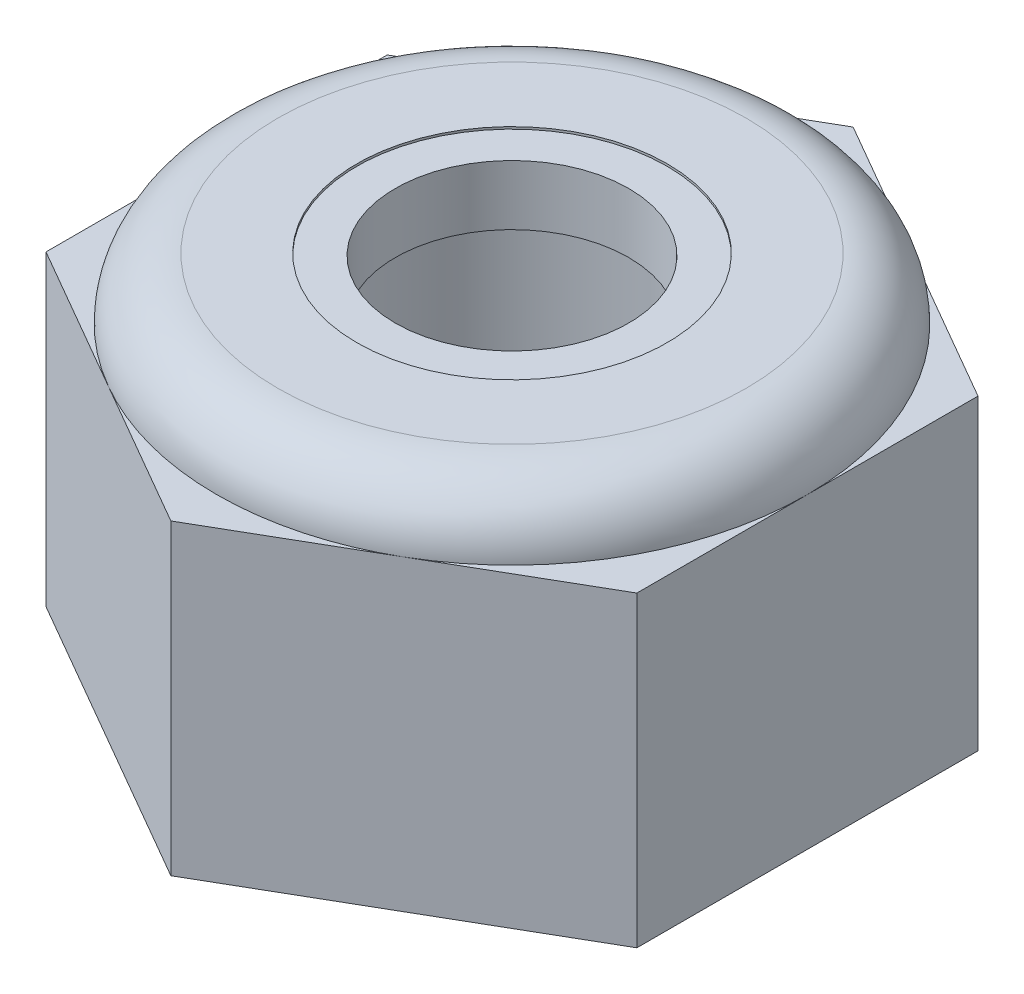
ISO-10303-21;
HEADER;
FILE_DESCRIPTION(('STEP AP214'),'2;1');
FILE_NAME('part.step','',(''),(''),'','','');
FILE_SCHEMA(('AUTOMOTIVE_DESIGN { 1 0 10303 214 1 1 1 1 }'));
ENDSEC;
DATA;
#1=APPLICATION_CONTEXT('core data for automotive mechanical design processes');
#2=APPLICATION_PROTOCOL_DEFINITION('international standard','automotive_design',2000,#1);
#3=PRODUCT_CONTEXT('',#1,'mechanical');
#4=PRODUCT('Part','Part','',(#3));
#5=PRODUCT_RELATED_PRODUCT_CATEGORY('part','',(#4));
#6=PRODUCT_DEFINITION_FORMATION('','',#4);
#7=PRODUCT_DEFINITION_CONTEXT('part definition',#1,'design');
#8=PRODUCT_DEFINITION('design','',#6,#7);
#9=PRODUCT_DEFINITION_SHAPE('','',#8);
#10=(LENGTH_UNIT() NAMED_UNIT(*) SI_UNIT(.MILLI.,.METRE.));
#11=(NAMED_UNIT(*) PLANE_ANGLE_UNIT() SI_UNIT($,.RADIAN.));
#12=(NAMED_UNIT(*) SI_UNIT($,.STERADIAN.) SOLID_ANGLE_UNIT());
#13=UNCERTAINTY_MEASURE_WITH_UNIT(LENGTH_MEASURE(1.E-05),#10,'distance_accuracy_value','');
#14=(GEOMETRIC_REPRESENTATION_CONTEXT(3) GLOBAL_UNCERTAINTY_ASSIGNED_CONTEXT((#13)) GLOBAL_UNIT_ASSIGNED_CONTEXT((#10,
#11,#12)) REPRESENTATION_CONTEXT('',''));
#15=CARTESIAN_POINT('',(0.,0.,0.));
#16=DIRECTION('',(0.,0.,1.));
#17=DIRECTION('',(1.,0.,0.));
#18=AXIS2_PLACEMENT_3D('',#15,#16,#17);
#19=CARTESIAN_POINT('',(0.,0.,0.));
#20=DIRECTION('',(0.,-1.,0.));
#21=DIRECTION('',(0.,0.,-1.));
#22=AXIS2_PLACEMENT_3D('',#19,#20,#21);
#23=CYLINDRICAL_SURFACE('',#22,2.09999999999999);
#24=CARTESIAN_POINT('',(0.,4.989999906,0.));
#25=DIRECTION('',(0.,-1.,0.));
#26=DIRECTION('',(0.,0.,-1.));
#27=AXIS2_PLACEMENT_3D('',#24,#25,#26);
#28=CIRCLE('',#27,2.1);
#29=CARTESIAN_POINT('',(0.,4.989999906,-2.1));
#30=VERTEX_POINT('',#29);
#31=EDGE_CURVE('E197',#30,#30,#28,.T.);
#32=ORIENTED_EDGE('',*,*,#31,.F.);
#33=EDGE_LOOP('',(#32));
#34=FACE_BOUND('',#33,.T.);
#35=CARTESIAN_POINT('',(0.,4.959999966,0.));
#36=DIRECTION('',(0.,-1.,0.));
#37=DIRECTION('',(0.,0.,-1.));
#38=AXIS2_PLACEMENT_3D('',#35,#36,#37);
#39=CIRCLE('',#38,2.09999999999999);
#40=CARTESIAN_POINT('',(0.,4.959999966,-2.09999999999999));
#41=VERTEX_POINT('',#40);
#42=EDGE_CURVE('E11',#41,#41,#39,.F.);
#43=ORIENTED_EDGE('',*,*,#42,.F.);
#44=EDGE_LOOP('',(#43));
#45=FACE_BOUND('',#44,.T.);
#46=ADVANCED_FACE('F37',(#34,#45),#23,.F.);
#47=CARTESIAN_POINT('',(0.,0.,0.));
#48=DIRECTION('',(0.,-1.,0.));
#49=DIRECTION('',(0.,0.,-1.));
#50=AXIS2_PLACEMENT_3D('',#47,#48,#49);
#51=CIRCLE('',#50,2.09999999999999);
#52=CARTESIAN_POINT('',(0.,0.,-2.09999999999999));
#53=VERTEX_POINT('',#52);
#54=EDGE_CURVE('E214',#53,#53,#51,.T.);
#55=ORIENTED_EDGE('',*,*,#54,.T.);
#56=EDGE_LOOP('',(#55));
#57=FACE_BOUND('',#56,.T.);
#58=CARTESIAN_POINT('',(0.,4.149999966,0.));
#59=DIRECTION('',(0.,1.,0.));
#60=DIRECTION('',(0.,0.,1.));
#61=AXIS2_PLACEMENT_3D('',#58,#59,#60);
#62=CIRCLE('',#61,2.09999999999999);
#63=CARTESIAN_POINT('',(0.,4.149999966,2.09999999999999));
#64=VERTEX_POINT('',#63);
#65=EDGE_CURVE('E45',#64,#64,#62,.F.);
#66=ORIENTED_EDGE('',*,*,#65,.F.);
#67=EDGE_LOOP('',(#66));
#68=FACE_BOUND('',#67,.T.);
#69=ADVANCED_FACE('F240',(#57,#68),#23,.F.);
#70=CARTESIAN_POINT('',(0.,0.,0.));
#71=DIRECTION('',(0.,1.,0.));
#72=DIRECTION('',(0.,0.,1.));
#73=AXIS2_PLACEMENT_3D('',#70,#71,#72);
#74=PLANE('',#73);
#75=DIRECTION('',(0.,0.,1.));
#76=VECTOR('',#75,1.);
#77=CARTESIAN_POINT('',(-4.,0.,-2.3094010767585));
#78=LINE('',#77,#76);
#79=CARTESIAN_POINT('',(-4.,0.,-2.3094010767585));
#80=VERTEX_POINT('',#79);
#81=CARTESIAN_POINT('',(-4.,0.,2.3094010767585));
#82=VERTEX_POINT('',#81);
#83=EDGE_CURVE('E148',#80,#82,#78,.T.);
#84=ORIENTED_EDGE('',*,*,#83,.F.);
#85=DIRECTION('',(-0.866025403784438,0.,0.5));
#86=VECTOR('',#85,1.);
#87=CARTESIAN_POINT('',(0.,0.,-4.61880215351701));
#88=LINE('',#87,#86);
#89=CARTESIAN_POINT('',(0.,0.,-4.61880215351701));
#90=VERTEX_POINT('',#89);
#91=EDGE_CURVE('E89',#90,#80,#88,.T.);
#92=ORIENTED_EDGE('',*,*,#91,.F.);
#93=DIRECTION('',(-0.866025403784439,0.,-0.5));
#94=VECTOR('',#93,1.);
#95=CARTESIAN_POINT('',(4.,0.,-2.3094010767585));
#96=LINE('',#95,#94);
#97=CARTESIAN_POINT('',(4.,0.,-2.3094010767585));
#98=VERTEX_POINT('',#97);
#99=EDGE_CURVE('E157',#98,#90,#96,.T.);
#100=ORIENTED_EDGE('',*,*,#99,.F.);
#101=DIRECTION('',(0.,0.,-1.));
#102=VECTOR('',#101,1.);
#103=CARTESIAN_POINT('',(4.,0.,2.3094010767585));
#104=LINE('',#103,#102);
#105=CARTESIAN_POINT('',(4.,0.,2.3094010767585));
#106=VERTEX_POINT('',#105);
#107=EDGE_CURVE('E131',#106,#98,#104,.T.);
#108=ORIENTED_EDGE('',*,*,#107,.F.);
#109=DIRECTION('',(0.866025403784438,0.,-0.5));
#110=VECTOR('',#109,1.);
#111=CARTESIAN_POINT('',(0.,0.,4.61880215351701));
#112=LINE('',#111,#110);
#113=CARTESIAN_POINT('',(0.,0.,4.61880215351701));
#114=VERTEX_POINT('',#113);
#115=EDGE_CURVE('E154',#114,#106,#112,.T.);
#116=ORIENTED_EDGE('',*,*,#115,.F.);
#117=DIRECTION('',(0.866025403784439,0.,0.5));
#118=VECTOR('',#117,1.);
#119=CARTESIAN_POINT('',(-4.,0.,2.3094010767585));
#120=LINE('',#119,#118);
#121=EDGE_CURVE('E151',#82,#114,#120,.T.);
#122=ORIENTED_EDGE('',*,*,#121,.F.);
#123=EDGE_LOOP('',(#84,#92,#100,#108,#116,#122));
#124=FACE_BOUND('',#123,.T.);
#125=ORIENTED_EDGE('',*,*,#54,.F.);
#126=EDGE_LOOP('',(#125));
#127=FACE_BOUND('',#126,.T.);
#128=ADVANCED_FACE('F246',(#124,#127),#74,.F.);
#129=CARTESIAN_POINT('',(0.,4.159999906,0.));
#130=DIRECTION('',(0.,1.,0.));
#131=DIRECTION('',(0.,0.,1.));
#132=AXIS2_PLACEMENT_3D('',#129,#130,#131);
#133=PLANE('',#132);
#134=DIRECTION('',(0.866025403784439,0.,0.5));
#135=VECTOR('',#134,1.);
#136=CARTESIAN_POINT('',(-4.,4.159999906,2.3094010767585));
#137=LINE('',#136,#135);
#138=CARTESIAN_POINT('',(-4.,4.159999906,2.3094010767585));
#139=VERTEX_POINT('',#138);
#140=CARTESIAN_POINT('',(-2.,4.159999906,3.46410161513775));
#141=VERTEX_POINT('',#140);
#142=EDGE_CURVE('E202',#139,#141,#137,.T.);
#143=ORIENTED_EDGE('',*,*,#142,.T.);
#144=CARTESIAN_POINT('',(0.,4.159999906,0.));
#145=DIRECTION('',(0.,1.,0.));
#146=DIRECTION('',(0.,0.,1.));
#147=AXIS2_PLACEMENT_3D('',#144,#145,#146);
#148=CIRCLE('',#147,4.);
#149=CARTESIAN_POINT('',(-4.,4.159999906,0.));
#150=VERTEX_POINT('',#149);
#151=EDGE_CURVE('E52',#141,#150,#148,.F.);
#152=ORIENTED_EDGE('',*,*,#151,.T.);
#153=DIRECTION('',(0.,0.,1.));
#154=VECTOR('',#153,1.);
#155=CARTESIAN_POINT('',(-4.,4.159999906,-2.3094010767585));
#156=LINE('',#155,#154);
#157=EDGE_CURVE('E97',#150,#139,#156,.T.);
#158=ORIENTED_EDGE('',*,*,#157,.T.);
#159=EDGE_LOOP('',(#143,#152,#158));
#160=FACE_BOUND('',#159,.T.);
#161=ADVANCED_FACE('F257',(#160),#133,.T.);
#162=CARTESIAN_POINT('',(-4.,4.159999906,-2.3094010767585));
#163=VERTEX_POINT('',#162);
#164=EDGE_CURVE('E208',#163,#150,#156,.T.);
#165=ORIENTED_EDGE('',*,*,#164,.T.);
#166=CARTESIAN_POINT('',(-2.,4.159999906,-3.46410161513775));
#167=VERTEX_POINT('',#166);
#168=EDGE_CURVE('E173',#150,#167,#148,.F.);
#169=ORIENTED_EDGE('',*,*,#168,.T.);
#170=DIRECTION('',(-0.866025403784438,0.,0.5));
#171=VECTOR('',#170,1.);
#172=CARTESIAN_POINT('',(0.,4.159999906,-4.61880215351701));
#173=LINE('',#172,#171);
#174=EDGE_CURVE('E61',#167,#163,#173,.T.);
#175=ORIENTED_EDGE('',*,*,#174,.T.);
#176=EDGE_LOOP('',(#165,#169,#175));
#177=FACE_BOUND('',#176,.T.);
#178=ADVANCED_FACE('F260',(#177),#133,.T.);
#179=CARTESIAN_POINT('',(0.,4.159999906,-4.61880215351701));
#180=VERTEX_POINT('',#179);
#181=EDGE_CURVE('E142',#180,#167,#173,.T.);
#182=ORIENTED_EDGE('',*,*,#181,.T.);
#183=CARTESIAN_POINT('',(2.,4.159999906,-3.46410161513775));
#184=VERTEX_POINT('',#183);
#185=EDGE_CURVE('E174',#167,#184,#148,.F.);
#186=ORIENTED_EDGE('',*,*,#185,.T.);
#187=DIRECTION('',(-0.866025403784439,0.,-0.5));
#188=VECTOR('',#187,1.);
#189=CARTESIAN_POINT('',(4.,4.159999906,-2.3094010767585));
#190=LINE('',#189,#188);
#191=EDGE_CURVE('E140',#184,#180,#190,.T.);
#192=ORIENTED_EDGE('',*,*,#191,.T.);
#193=EDGE_LOOP('',(#182,#186,#192));
#194=FACE_BOUND('',#193,.T.);
#195=ADVANCED_FACE('F179',(#194),#133,.T.);
#196=CARTESIAN_POINT('',(4.,4.159999906,-2.3094010767585));
#197=VERTEX_POINT('',#196);
#198=EDGE_CURVE('E116',#197,#184,#190,.T.);
#199=ORIENTED_EDGE('',*,*,#198,.T.);
#200=CARTESIAN_POINT('',(4.,4.159999906,0.));
#201=VERTEX_POINT('',#200);
#202=EDGE_CURVE('E119',#184,#201,#148,.F.);
#203=ORIENTED_EDGE('',*,*,#202,.T.);
#204=DIRECTION('',(0.,0.,-1.));
#205=VECTOR('',#204,1.);
#206=CARTESIAN_POINT('',(4.,4.159999906,2.3094010767585));
#207=LINE('',#206,#205);
#208=EDGE_CURVE('E111',#201,#197,#207,.T.);
#209=ORIENTED_EDGE('',*,*,#208,.T.);
#210=EDGE_LOOP('',(#199,#203,#209));
#211=FACE_BOUND('',#210,.T.);
#212=ADVANCED_FACE('F113',(#211),#133,.T.);
#213=CARTESIAN_POINT('',(4.,4.159999906,2.3094010767585));
#214=VERTEX_POINT('',#213);
#215=EDGE_CURVE('E123',#214,#201,#207,.T.);
#216=ORIENTED_EDGE('',*,*,#215,.T.);
#217=CARTESIAN_POINT('',(0.,4.159999906,0.));
#218=DIRECTION('',(0.,1.,0.));
#219=DIRECTION('',(0.,0.,1.));
#220=AXIS2_PLACEMENT_3D('',#217,#218,#219);
#221=CIRCLE('',#220,4.);
#222=CARTESIAN_POINT('',(2.,4.159999906,3.46410161513775));
#223=VERTEX_POINT('',#222);
#224=EDGE_CURVE('E188',#223,#201,#221,.T.);
#225=ORIENTED_EDGE('',*,*,#224,.F.);
#226=DIRECTION('',(0.866025403784438,0.,-0.5));
#227=VECTOR('',#226,1.);
#228=CARTESIAN_POINT('',(0.,4.159999906,4.61880215351701));
#229=LINE('',#228,#227);
#230=EDGE_CURVE('E195',#223,#214,#229,.T.);
#231=ORIENTED_EDGE('',*,*,#230,.T.);
#232=EDGE_LOOP('',(#216,#225,#231));
#233=FACE_BOUND('',#232,.T.);
#234=ADVANCED_FACE('F194',(#233),#133,.T.);
#235=CARTESIAN_POINT('',(0.,4.159999906,4.61880215351701));
#236=VERTEX_POINT('',#235);
#237=EDGE_CURVE('E124',#236,#223,#229,.T.);
#238=ORIENTED_EDGE('',*,*,#237,.T.);
#239=EDGE_CURVE('E169',#223,#141,#148,.F.);
#240=ORIENTED_EDGE('',*,*,#239,.T.);
#241=EDGE_CURVE('E204',#141,#236,#137,.T.);
#242=ORIENTED_EDGE('',*,*,#241,.T.);
#243=EDGE_LOOP('',(#238,#240,#242));
#244=FACE_BOUND('',#243,.T.);
#245=ADVANCED_FACE('F203',(#244),#133,.T.);
#246=CARTESIAN_POINT('',(-4.,4.159999906,-2.3094010767585));
#247=DIRECTION('',(1.,0.,0.));
#248=DIRECTION('',(0.,0.,-1.));
#249=AXIS2_PLACEMENT_3D('',#246,#247,#248);
#250=PLANE('',#249);
#251=ORIENTED_EDGE('',*,*,#83,.T.);
#252=DIRECTION('',(0.,-1.,0.));
#253=VECTOR('',#252,1.);
#254=CARTESIAN_POINT('',(-4.,4.159999906,2.3094010767585));
#255=LINE('',#254,#253);
#256=EDGE_CURVE('E166',#139,#82,#255,.T.);
#257=ORIENTED_EDGE('',*,*,#256,.F.);
#258=ORIENTED_EDGE('',*,*,#157,.F.);
#259=ORIENTED_EDGE('',*,*,#164,.F.);
#260=DIRECTION('',(0.,-1.,0.));
#261=VECTOR('',#260,1.);
#262=CARTESIAN_POINT('',(-4.,4.159999906,-2.3094010767585));
#263=LINE('',#262,#261);
#264=EDGE_CURVE('E147',#163,#80,#263,.T.);
#265=ORIENTED_EDGE('',*,*,#264,.T.);
#266=EDGE_LOOP('',(#251,#257,#258,#259,#265));
#267=FACE_BOUND('',#266,.T.);
#268=ADVANCED_FACE('F39',(#267),#250,.F.);
#269=CARTESIAN_POINT('',(-4.,4.159999906,2.3094010767585));
#270=DIRECTION('',(0.5,0.,-0.866025403784439));
#271=DIRECTION('',(-0.866025403784439,0.,-0.5));
#272=AXIS2_PLACEMENT_3D('',#269,#270,#271);
#273=PLANE('',#272);
#274=ORIENTED_EDGE('',*,*,#121,.T.);
#275=DIRECTION('',(0.,-1.,0.));
#276=VECTOR('',#275,1.);
#277=CARTESIAN_POINT('',(0.,4.159999906,4.61880215351701));
#278=LINE('',#277,#276);
#279=EDGE_CURVE('E163',#236,#114,#278,.T.);
#280=ORIENTED_EDGE('',*,*,#279,.F.);
#281=ORIENTED_EDGE('',*,*,#241,.F.);
#282=ORIENTED_EDGE('',*,*,#142,.F.);
#283=ORIENTED_EDGE('',*,*,#256,.T.);
#284=EDGE_LOOP('',(#274,#280,#281,#282,#283));
#285=FACE_BOUND('',#284,.T.);
#286=ADVANCED_FACE('F271',(#285),#273,.F.);
#287=CARTESIAN_POINT('',(0.,4.159999906,4.61880215351701));
#288=DIRECTION('',(-0.5,0.,-0.866025403784438));
#289=DIRECTION('',(-0.866025403784439,0.,0.5));
#290=AXIS2_PLACEMENT_3D('',#287,#288,#289);
#291=PLANE('',#290);
#292=ORIENTED_EDGE('',*,*,#115,.T.);
#293=DIRECTION('',(0.,-1.,0.));
#294=VECTOR('',#293,1.);
#295=CARTESIAN_POINT('',(4.,4.159999906,2.3094010767585));
#296=LINE('',#295,#294);
#297=EDGE_CURVE('E134',#214,#106,#296,.T.);
#298=ORIENTED_EDGE('',*,*,#297,.F.);
#299=ORIENTED_EDGE('',*,*,#230,.F.);
#300=ORIENTED_EDGE('',*,*,#237,.F.);
#301=ORIENTED_EDGE('',*,*,#279,.T.);
#302=EDGE_LOOP('',(#292,#298,#299,#300,#301));
#303=FACE_BOUND('',#302,.T.);
#304=ADVANCED_FACE('F201',(#303),#291,.F.);
#305=CARTESIAN_POINT('',(4.,4.159999906,2.3094010767585));
#306=DIRECTION('',(-1.,0.,0.));
#307=DIRECTION('',(0.,0.,1.));
#308=AXIS2_PLACEMENT_3D('',#305,#306,#307);
#309=PLANE('',#308);
#310=ORIENTED_EDGE('',*,*,#107,.T.);
#311=DIRECTION('',(0.,-1.,0.));
#312=VECTOR('',#311,1.);
#313=CARTESIAN_POINT('',(4.,4.159999906,-2.3094010767585));
#314=LINE('',#313,#312);
#315=EDGE_CURVE('E127',#197,#98,#314,.T.);
#316=ORIENTED_EDGE('',*,*,#315,.F.);
#317=ORIENTED_EDGE('',*,*,#208,.F.);
#318=ORIENTED_EDGE('',*,*,#215,.F.);
#319=ORIENTED_EDGE('',*,*,#297,.T.);
#320=EDGE_LOOP('',(#310,#316,#317,#318,#319));
#321=FACE_BOUND('',#320,.T.);
#322=ADVANCED_FACE('F128',(#321),#309,.F.);
#323=CARTESIAN_POINT('',(4.,4.159999906,-2.3094010767585));
#324=DIRECTION('',(-0.5,0.,0.866025403784439));
#325=DIRECTION('',(0.866025403784439,0.,0.5));
#326=AXIS2_PLACEMENT_3D('',#323,#324,#325);
#327=PLANE('',#326);
#328=ORIENTED_EDGE('',*,*,#99,.T.);
#329=DIRECTION('',(0.,-1.,0.));
#330=VECTOR('',#329,1.);
#331=CARTESIAN_POINT('',(0.,4.159999906,-4.61880215351701));
#332=LINE('',#331,#330);
#333=EDGE_CURVE('E135',#180,#90,#332,.T.);
#334=ORIENTED_EDGE('',*,*,#333,.F.);
#335=ORIENTED_EDGE('',*,*,#191,.F.);
#336=ORIENTED_EDGE('',*,*,#198,.F.);
#337=ORIENTED_EDGE('',*,*,#315,.T.);
#338=EDGE_LOOP('',(#328,#334,#335,#336,#337));
#339=FACE_BOUND('',#338,.T.);
#340=ADVANCED_FACE('F138',(#339),#327,.F.);
#341=CARTESIAN_POINT('',(0.,4.159999906,-4.61880215351701));
#342=DIRECTION('',(0.5,0.,0.866025403784438));
#343=DIRECTION('',(0.866025403784439,0.,-0.5));
#344=AXIS2_PLACEMENT_3D('',#341,#342,#343);
#345=PLANE('',#344);
#346=ORIENTED_EDGE('',*,*,#91,.T.);
#347=ORIENTED_EDGE('',*,*,#264,.F.);
#348=ORIENTED_EDGE('',*,*,#174,.F.);
#349=ORIENTED_EDGE('',*,*,#181,.F.);
#350=ORIENTED_EDGE('',*,*,#333,.T.);
#351=EDGE_LOOP('',(#346,#347,#348,#349,#350));
#352=FACE_BOUND('',#351,.T.);
#353=ADVANCED_FACE('F255',(#352),#345,.F.);
#354=CARTESIAN_POINT('',(0.,4.159999906,0.));
#355=DIRECTION('',(0.,1.,0.));
#356=DIRECTION('',(0.,0.,1.));
#357=AXIS2_PLACEMENT_3D('',#354,#355,#356);
#358=TOROIDAL_SURFACE('',#357,3.17,0.83);
#359=CARTESIAN_POINT('',(0.,4.989999906,0.));
#360=DIRECTION('',(0.,1.,0.));
#361=DIRECTION('',(0.,0.,1.));
#362=AXIS2_PLACEMENT_3D('',#359,#360,#361);
#363=CIRCLE('',#362,3.17);
#364=CARTESIAN_POINT('',(0.,4.989999906,3.17));
#365=VERTEX_POINT('',#364);
#366=EDGE_CURVE('E152',#365,#365,#363,.T.);
#367=ORIENTED_EDGE('',*,*,#366,.F.);
#368=EDGE_LOOP('',(#367));
#369=FACE_BOUND('',#368,.T.);
#370=ORIENTED_EDGE('',*,*,#224,.T.);
#371=ORIENTED_EDGE('',*,*,#202,.F.);
#372=ORIENTED_EDGE('',*,*,#185,.F.);
#373=ORIENTED_EDGE('',*,*,#168,.F.);
#374=ORIENTED_EDGE('',*,*,#151,.F.);
#375=ORIENTED_EDGE('',*,*,#239,.F.);
#376=EDGE_LOOP('',(#370,#371,#372,#373,#374,#375));
#377=FACE_BOUND('',#376,.T.);
#378=ADVANCED_FACE('F183',(#369,#377),#358,.T.);
#379=CARTESIAN_POINT('',(3.17,4.989999906,0.));
#380=DIRECTION('',(0.,-1.,0.));
#381=DIRECTION('',(0.,0.,-1.));
#382=AXIS2_PLACEMENT_3D('',#379,#380,#381);
#383=PLANE('',#382);
#384=ORIENTED_EDGE('',*,*,#31,.T.);
#385=EDGE_LOOP('',(#384));
#386=FACE_BOUND('',#385,.T.);
#387=ORIENTED_EDGE('',*,*,#366,.T.);
#388=EDGE_LOOP('',(#387));
#389=FACE_BOUND('',#388,.T.);
#390=ADVANCED_FACE('F235',(#386,#389),#383,.F.);
#391=CARTESIAN_POINT('',(2.09999999999999,4.959999966,0.));
#392=DIRECTION('',(0.,-1.,0.));
#393=DIRECTION('',(0.,0.,-1.));
#394=AXIS2_PLACEMENT_3D('',#391,#392,#393);
#395=PLANE('',#394);
#396=CARTESIAN_POINT('',(0.,4.959999966,0.));
#397=DIRECTION('',(0.,1.,0.));
#398=DIRECTION('',(0.,0.,1.));
#399=AXIS2_PLACEMENT_3D('',#396,#397,#398);
#400=CIRCLE('',#399,1.57999999999999);
#401=CARTESIAN_POINT('',(0.,4.959999966,1.57999999999999));
#402=VERTEX_POINT('',#401);
#403=EDGE_CURVE('E217',#402,#402,#400,.T.);
#404=ORIENTED_EDGE('',*,*,#403,.F.);
#405=EDGE_LOOP('',(#404));
#406=FACE_BOUND('',#405,.T.);
#407=ORIENTED_EDGE('',*,*,#42,.T.);
#408=EDGE_LOOP('',(#407));
#409=FACE_BOUND('',#408,.T.);
#410=ADVANCED_FACE('F229',(#406,#409),#395,.F.);
#411=CARTESIAN_POINT('',(0.,4.989999906,0.));
#412=DIRECTION('',(0.,1.,0.));
#413=DIRECTION('',(0.,0.,1.));
#414=AXIS2_PLACEMENT_3D('',#411,#412,#413);
#415=CYLINDRICAL_SURFACE('',#414,1.57999999999999);
#416=CARTESIAN_POINT('',(0.,4.149999966,0.));
#417=DIRECTION('',(0.,1.,0.));
#418=DIRECTION('',(0.,0.,1.));
#419=AXIS2_PLACEMENT_3D('',#416,#417,#418);
#420=CIRCLE('',#419,1.57999999999999);
#421=CARTESIAN_POINT('',(0.,4.149999966,1.57999999999999));
#422=VERTEX_POINT('',#421);
#423=EDGE_CURVE('E220',#422,#422,#420,.T.);
#424=ORIENTED_EDGE('',*,*,#423,.F.);
#425=EDGE_LOOP('',(#424));
#426=FACE_BOUND('',#425,.T.);
#427=ORIENTED_EDGE('',*,*,#403,.T.);
#428=EDGE_LOOP('',(#427));
#429=FACE_BOUND('',#428,.T.);
#430=ADVANCED_FACE('F226',(#426,#429),#415,.F.);
#431=CARTESIAN_POINT('',(1.57999999999999,4.149999966,0.));
#432=DIRECTION('',(0.,1.,0.));
#433=DIRECTION('',(0.,0.,1.));
#434=AXIS2_PLACEMENT_3D('',#431,#432,#433);
#435=PLANE('',#434);
#436=ORIENTED_EDGE('',*,*,#65,.T.);
#437=EDGE_LOOP('',(#436));
#438=FACE_BOUND('',#437,.T.);
#439=ORIENTED_EDGE('',*,*,#423,.T.);
#440=EDGE_LOOP('',(#439));
#441=FACE_BOUND('',#440,.T.);
#442=ADVANCED_FACE('F224',(#438,#441),#435,.F.);
#443=CLOSED_SHELL('',(#46,#69,#128,#161,#178,#195,#212,#234,#245,#268,#286,#304,#322,#340,#353,
#378,#390,#410,#430,#442));
#444=MANIFOLD_SOLID_BREP('B2',#443);
#445=ADVANCED_BREP_SHAPE_REPRESENTATION('',(#18,#444),#14);
#446=SHAPE_DEFINITION_REPRESENTATION(#9,#445);
ENDSEC;
END-ISO-10303-21;
